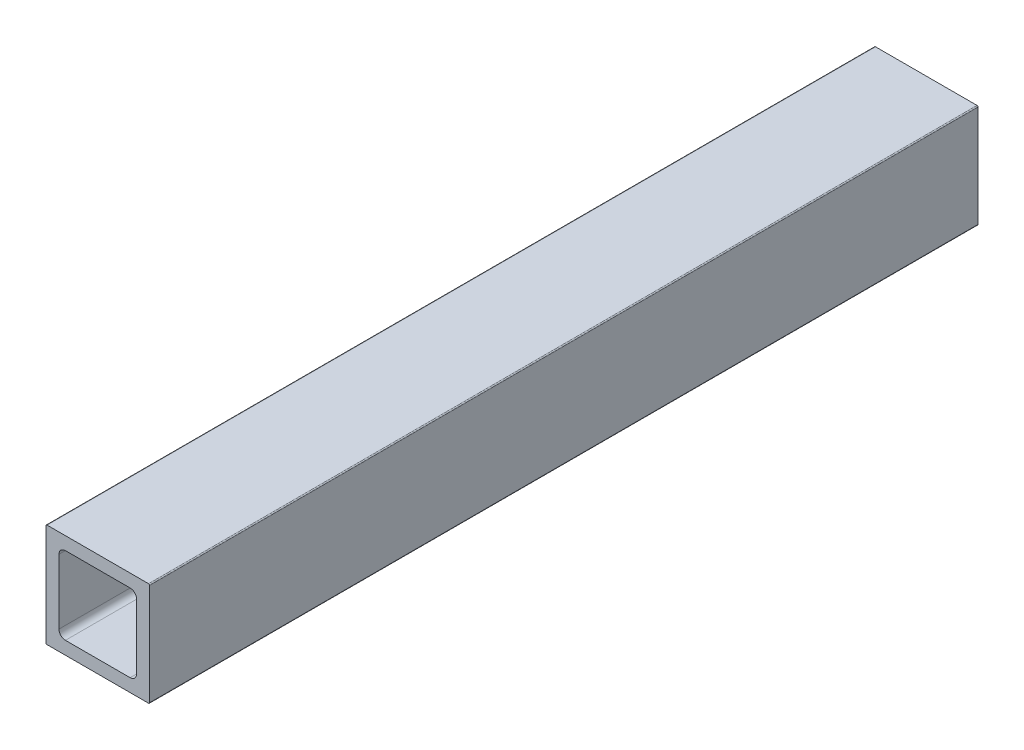
ISO-10303-21;
HEADER;
FILE_DESCRIPTION(('STEP AP214'),'2;1');
FILE_NAME('part.step','',(''),(''),'','','');
FILE_SCHEMA(('AUTOMOTIVE_DESIGN { 1 0 10303 214 1 1 1 1 }'));
ENDSEC;
DATA;
#1=APPLICATION_CONTEXT('core data for automotive mechanical design processes');
#2=APPLICATION_PROTOCOL_DEFINITION('international standard','automotive_design',2000,#1);
#3=PRODUCT_CONTEXT('',#1,'mechanical');
#4=PRODUCT('Part','Part','',(#3));
#5=PRODUCT_RELATED_PRODUCT_CATEGORY('part','',(#4));
#6=PRODUCT_DEFINITION_FORMATION('','',#4);
#7=PRODUCT_DEFINITION_CONTEXT('part definition',#1,'design');
#8=PRODUCT_DEFINITION('design','',#6,#7);
#9=PRODUCT_DEFINITION_SHAPE('','',#8);
#10=(LENGTH_UNIT() NAMED_UNIT(*) SI_UNIT(.MILLI.,.METRE.));
#11=(NAMED_UNIT(*) PLANE_ANGLE_UNIT() SI_UNIT($,.RADIAN.));
#12=(NAMED_UNIT(*) SI_UNIT($,.STERADIAN.) SOLID_ANGLE_UNIT());
#13=UNCERTAINTY_MEASURE_WITH_UNIT(LENGTH_MEASURE(1.E-05),#10,'distance_accuracy_value','');
#14=(GEOMETRIC_REPRESENTATION_CONTEXT(3) GLOBAL_UNCERTAINTY_ASSIGNED_CONTEXT((#13)) GLOBAL_UNIT_ASSIGNED_CONTEXT((#10,
#11,#12)) REPRESENTATION_CONTEXT('',''));
#15=CARTESIAN_POINT('',(0.,0.,0.));
#16=DIRECTION('',(0.,0.,1.));
#17=DIRECTION('',(1.,0.,0.));
#18=AXIS2_PLACEMENT_3D('',#15,#16,#17);
#19=CARTESIAN_POINT('',(3.175,4.7625,1828.8));
#20=DIRECTION('',(1.,0.,0.));
#21=DIRECTION('',(0.,1.,0.));
#22=AXIS2_PLACEMENT_3D('',#19,#20,#21);
#23=PLANE('',#22);
#24=DIRECTION('',(0.,-1.,0.));
#25=VECTOR('',#24,1.);
#26=CARTESIAN_POINT('',(3.175,4.7625,1625.6));
#27=LINE('',#26,#25);
#28=CARTESIAN_POINT('',(3.175,20.6375,1625.6));
#29=VERTEX_POINT('',#28);
#30=CARTESIAN_POINT('',(3.175,4.7625,1625.6));
#31=VERTEX_POINT('',#30);
#32=EDGE_CURVE('E58',#29,#31,#27,.T.);
#33=ORIENTED_EDGE('',*,*,#32,.F.);
#34=DIRECTION('',(0.,0.,-1.));
#35=VECTOR('',#34,1.);
#36=CARTESIAN_POINT('',(3.175,20.6375,1828.8));
#37=LINE('',#36,#35);
#38=CARTESIAN_POINT('',(3.175,20.6375,1828.8));
#39=VERTEX_POINT('',#38);
#40=EDGE_CURVE('E51',#39,#29,#37,.T.);
#41=ORIENTED_EDGE('',*,*,#40,.F.);
#42=DIRECTION('',(0.,-1.,0.));
#43=VECTOR('',#42,1.);
#44=CARTESIAN_POINT('',(3.175,4.7625,1828.8));
#45=LINE('',#44,#43);
#46=CARTESIAN_POINT('',(3.175,4.7625,1828.8));
#47=VERTEX_POINT('',#46);
#48=EDGE_CURVE('E217',#39,#47,#45,.T.);
#49=ORIENTED_EDGE('',*,*,#48,.T.);
#50=DIRECTION('',(0.,0.,-1.));
#51=VECTOR('',#50,1.);
#52=CARTESIAN_POINT('',(3.175,4.7625,1828.8));
#53=LINE('',#52,#51);
#54=EDGE_CURVE('E323',#47,#31,#53,.T.);
#55=ORIENTED_EDGE('',*,*,#54,.T.);
#56=EDGE_LOOP('',(#33,#41,#49,#55));
#57=FACE_BOUND('',#56,.T.);
#58=ADVANCED_FACE('F43',(#57),#23,.T.);
#59=CARTESIAN_POINT('',(4.7625,20.6375,1828.8));
#60=DIRECTION('',(0.,0.,-1.));
#61=DIRECTION('',(-1.,0.,0.));
#62=AXIS2_PLACEMENT_3D('',#59,#60,#61);
#63=CYLINDRICAL_SURFACE('',#62,1.5875);
#64=ORIENTED_EDGE('',*,*,#40,.T.);
#65=CARTESIAN_POINT('',(4.7625,20.6375,1625.6));
#66=DIRECTION('',(0.,0.,1.));
#67=DIRECTION('',(1.,0.,0.));
#68=AXIS2_PLACEMENT_3D('',#65,#66,#67);
#69=CIRCLE('',#68,1.5875);
#70=CARTESIAN_POINT('',(4.7625,22.225,1625.6));
#71=VERTEX_POINT('',#70);
#72=EDGE_CURVE('E302',#29,#71,#69,.F.);
#73=ORIENTED_EDGE('',*,*,#72,.T.);
#74=DIRECTION('',(0.,0.,-1.));
#75=VECTOR('',#74,1.);
#76=CARTESIAN_POINT('',(4.7625,22.225,1828.8));
#77=LINE('',#76,#75);
#78=CARTESIAN_POINT('',(4.7625,22.225,1828.8));
#79=VERTEX_POINT('',#78);
#80=EDGE_CURVE('E290',#79,#71,#77,.T.);
#81=ORIENTED_EDGE('',*,*,#80,.F.);
#82=CARTESIAN_POINT('',(4.7625,20.6375,1828.8));
#83=DIRECTION('',(0.,0.,1.));
#84=DIRECTION('',(-1.,0.,0.));
#85=AXIS2_PLACEMENT_3D('',#82,#83,#84);
#86=CIRCLE('',#85,1.5875);
#87=EDGE_CURVE('E222',#79,#39,#86,.T.);
#88=ORIENTED_EDGE('',*,*,#87,.T.);
#89=EDGE_LOOP('',(#64,#73,#81,#88));
#90=FACE_BOUND('',#89,.T.);
#91=ADVANCED_FACE('F300',(#90),#63,.F.);
#92=CARTESIAN_POINT('',(4.7625,22.225,1828.8));
#93=DIRECTION('',(0.,-1.,0.));
#94=DIRECTION('',(0.,0.,-1.));
#95=AXIS2_PLACEMENT_3D('',#92,#93,#94);
#96=PLANE('',#95);
#97=DIRECTION('',(-1.,0.,0.));
#98=VECTOR('',#97,1.);
#99=CARTESIAN_POINT('',(4.7625,22.225,1625.6));
#100=LINE('',#99,#98);
#101=CARTESIAN_POINT('',(20.6375,22.225,1625.6));
#102=VERTEX_POINT('',#101);
#103=EDGE_CURVE('E338',#102,#71,#100,.T.);
#104=ORIENTED_EDGE('',*,*,#103,.F.);
#105=DIRECTION('',(0.,0.,-1.));
#106=VECTOR('',#105,1.);
#107=CARTESIAN_POINT('',(20.6375,22.225,1828.8));
#108=LINE('',#107,#106);
#109=CARTESIAN_POINT('',(20.6375,22.225,1828.8));
#110=VERTEX_POINT('',#109);
#111=EDGE_CURVE('E237',#110,#102,#108,.T.);
#112=ORIENTED_EDGE('',*,*,#111,.F.);
#113=DIRECTION('',(-1.,0.,0.));
#114=VECTOR('',#113,1.);
#115=CARTESIAN_POINT('',(4.7625,22.225,1828.8));
#116=LINE('',#115,#114);
#117=EDGE_CURVE('E226',#110,#79,#116,.T.);
#118=ORIENTED_EDGE('',*,*,#117,.T.);
#119=ORIENTED_EDGE('',*,*,#80,.T.);
#120=EDGE_LOOP('',(#104,#112,#118,#119));
#121=FACE_BOUND('',#120,.T.);
#122=ADVANCED_FACE('F289',(#121),#96,.T.);
#123=CARTESIAN_POINT('',(20.6375,20.6375,1828.8));
#124=DIRECTION('',(0.,0.,-1.));
#125=DIRECTION('',(-1.,0.,0.));
#126=AXIS2_PLACEMENT_3D('',#123,#124,#125);
#127=CYLINDRICAL_SURFACE('',#126,1.5875);
#128=ORIENTED_EDGE('',*,*,#111,.T.);
#129=CARTESIAN_POINT('',(20.6375,20.6375,1625.6));
#130=DIRECTION('',(0.,0.,1.));
#131=DIRECTION('',(1.,0.,0.));
#132=AXIS2_PLACEMENT_3D('',#129,#130,#131);
#133=CIRCLE('',#132,1.5875);
#134=CARTESIAN_POINT('',(22.225,20.6375,1625.6));
#135=VERTEX_POINT('',#134);
#136=EDGE_CURVE('E340',#102,#135,#133,.F.);
#137=ORIENTED_EDGE('',*,*,#136,.T.);
#138=DIRECTION('',(0.,0.,-1.));
#139=VECTOR('',#138,1.);
#140=CARTESIAN_POINT('',(22.225,20.6375,1828.8));
#141=LINE('',#140,#139);
#142=CARTESIAN_POINT('',(22.225,20.6375,1828.8));
#143=VERTEX_POINT('',#142);
#144=EDGE_CURVE('E233',#143,#135,#141,.T.);
#145=ORIENTED_EDGE('',*,*,#144,.F.);
#146=CARTESIAN_POINT('',(20.6375,20.6375,1828.8));
#147=DIRECTION('',(0.,0.,1.));
#148=DIRECTION('',(-1.,0.,0.));
#149=AXIS2_PLACEMENT_3D('',#146,#147,#148);
#150=CIRCLE('',#149,1.5875);
#151=EDGE_CURVE('E212',#143,#110,#150,.T.);
#152=ORIENTED_EDGE('',*,*,#151,.T.);
#153=EDGE_LOOP('',(#128,#137,#145,#152));
#154=FACE_BOUND('',#153,.T.);
#155=ADVANCED_FACE('F525',(#154),#127,.F.);
#156=CARTESIAN_POINT('',(22.225,4.7625,1828.8));
#157=DIRECTION('',(-1.,0.,0.));
#158=DIRECTION('',(0.,0.,1.));
#159=AXIS2_PLACEMENT_3D('',#156,#157,#158);
#160=PLANE('',#159);
#161=DIRECTION('',(0.,1.,0.));
#162=VECTOR('',#161,1.);
#163=CARTESIAN_POINT('',(22.225,4.7625,1625.6));
#164=LINE('',#163,#162);
#165=CARTESIAN_POINT('',(22.225,4.7625,1625.6));
#166=VERTEX_POINT('',#165);
#167=EDGE_CURVE('E343',#166,#135,#164,.T.);
#168=ORIENTED_EDGE('',*,*,#167,.F.);
#169=DIRECTION('',(0.,0.,-1.));
#170=VECTOR('',#169,1.);
#171=CARTESIAN_POINT('',(22.225,4.7625,1828.8));
#172=LINE('',#171,#170);
#173=CARTESIAN_POINT('',(22.225,4.7625,1828.8));
#174=VERTEX_POINT('',#173);
#175=EDGE_CURVE('E238',#174,#166,#172,.T.);
#176=ORIENTED_EDGE('',*,*,#175,.F.);
#177=DIRECTION('',(0.,1.,0.));
#178=VECTOR('',#177,1.);
#179=CARTESIAN_POINT('',(22.225,4.7625,1828.8));
#180=LINE('',#179,#178);
#181=EDGE_CURVE('E207',#174,#143,#180,.T.);
#182=ORIENTED_EDGE('',*,*,#181,.T.);
#183=ORIENTED_EDGE('',*,*,#144,.T.);
#184=EDGE_LOOP('',(#168,#176,#182,#183));
#185=FACE_BOUND('',#184,.T.);
#186=ADVANCED_FACE('F395',(#185),#160,.T.);
#187=CARTESIAN_POINT('',(20.6375,4.7625,1828.8));
#188=DIRECTION('',(0.,0.,-1.));
#189=DIRECTION('',(-1.,0.,0.));
#190=AXIS2_PLACEMENT_3D('',#187,#188,#189);
#191=CYLINDRICAL_SURFACE('',#190,1.5875);
#192=ORIENTED_EDGE('',*,*,#175,.T.);
#193=CARTESIAN_POINT('',(20.6375,4.7625,1625.6));
#194=DIRECTION('',(0.,0.,1.));
#195=DIRECTION('',(1.,0.,0.));
#196=AXIS2_PLACEMENT_3D('',#193,#194,#195);
#197=CIRCLE('',#196,1.5875);
#198=CARTESIAN_POINT('',(20.6375,3.175,1625.6));
#199=VERTEX_POINT('',#198);
#200=EDGE_CURVE('E345',#166,#199,#197,.F.);
#201=ORIENTED_EDGE('',*,*,#200,.T.);
#202=DIRECTION('',(0.,0.,-1.));
#203=VECTOR('',#202,1.);
#204=CARTESIAN_POINT('',(20.6375,3.175,1828.8));
#205=LINE('',#204,#203);
#206=CARTESIAN_POINT('',(20.6375,3.175,1828.8));
#207=VERTEX_POINT('',#206);
#208=EDGE_CURVE('E264',#207,#199,#205,.T.);
#209=ORIENTED_EDGE('',*,*,#208,.F.);
#210=CARTESIAN_POINT('',(20.6375,4.7625,1828.8));
#211=DIRECTION('',(0.,0.,1.));
#212=DIRECTION('',(-1.,0.,0.));
#213=AXIS2_PLACEMENT_3D('',#210,#211,#212);
#214=CIRCLE('',#213,1.5875);
#215=EDGE_CURVE('E211',#207,#174,#214,.T.);
#216=ORIENTED_EDGE('',*,*,#215,.T.);
#217=EDGE_LOOP('',(#192,#201,#209,#216));
#218=FACE_BOUND('',#217,.T.);
#219=ADVANCED_FACE('F392',(#218),#191,.F.);
#220=CARTESIAN_POINT('',(4.7625,3.175,1828.8));
#221=DIRECTION('',(0.,1.,0.));
#222=DIRECTION('',(1.,0.,0.));
#223=AXIS2_PLACEMENT_3D('',#220,#221,#222);
#224=PLANE('',#223);
#225=DIRECTION('',(1.,0.,0.));
#226=VECTOR('',#225,1.);
#227=CARTESIAN_POINT('',(4.7625,3.175,1625.6));
#228=LINE('',#227,#226);
#229=CARTESIAN_POINT('',(4.7625,3.175,1625.6));
#230=VERTEX_POINT('',#229);
#231=EDGE_CURVE('E348',#230,#199,#228,.T.);
#232=ORIENTED_EDGE('',*,*,#231,.F.);
#233=DIRECTION('',(0.,0.,-1.));
#234=VECTOR('',#233,1.);
#235=CARTESIAN_POINT('',(4.7625,3.175,1828.8));
#236=LINE('',#235,#234);
#237=CARTESIAN_POINT('',(4.7625,3.175,1828.8));
#238=VERTEX_POINT('',#237);
#239=EDGE_CURVE('E268',#238,#230,#236,.T.);
#240=ORIENTED_EDGE('',*,*,#239,.F.);
#241=DIRECTION('',(1.,0.,0.));
#242=VECTOR('',#241,1.);
#243=CARTESIAN_POINT('',(4.7625,3.175,1828.8));
#244=LINE('',#243,#242);
#245=EDGE_CURVE('E254',#238,#207,#244,.T.);
#246=ORIENTED_EDGE('',*,*,#245,.T.);
#247=ORIENTED_EDGE('',*,*,#208,.T.);
#248=EDGE_LOOP('',(#232,#240,#246,#247));
#249=FACE_BOUND('',#248,.T.);
#250=ADVANCED_FACE('F394',(#249),#224,.T.);
#251=CARTESIAN_POINT('',(4.7625,4.7625,1828.8));
#252=DIRECTION('',(0.,0.,-1.));
#253=DIRECTION('',(-1.,0.,0.));
#254=AXIS2_PLACEMENT_3D('',#251,#252,#253);
#255=CYLINDRICAL_SURFACE('',#254,1.5875);
#256=ORIENTED_EDGE('',*,*,#239,.T.);
#257=CARTESIAN_POINT('',(4.7625,4.7625,1625.6));
#258=DIRECTION('',(0.,0.,1.));
#259=DIRECTION('',(1.,0.,0.));
#260=AXIS2_PLACEMENT_3D('',#257,#258,#259);
#261=CIRCLE('',#260,1.5875);
#262=EDGE_CURVE('E350',#230,#31,#261,.F.);
#263=ORIENTED_EDGE('',*,*,#262,.T.);
#264=ORIENTED_EDGE('',*,*,#54,.F.);
#265=CARTESIAN_POINT('',(4.7625,4.7625,1828.8));
#266=DIRECTION('',(0.,0.,1.));
#267=DIRECTION('',(1.,0.,0.));
#268=AXIS2_PLACEMENT_3D('',#265,#266,#267);
#269=CIRCLE('',#268,1.5875);
#270=EDGE_CURVE('E213',#47,#238,#269,.T.);
#271=ORIENTED_EDGE('',*,*,#270,.T.);
#272=EDGE_LOOP('',(#256,#263,#264,#271));
#273=FACE_BOUND('',#272,.T.);
#274=ADVANCED_FACE('F508',(#273),#255,.F.);
#275=CARTESIAN_POINT('',(0.,0.254,1828.8));
#276=DIRECTION('',(1.,0.,0.));
#277=DIRECTION('',(0.,1.,0.));
#278=AXIS2_PLACEMENT_3D('',#275,#276,#277);
#279=PLANE('',#278);
#280=DIRECTION('',(0.,0.,-1.));
#281=VECTOR('',#280,1.);
#282=CARTESIAN_POINT('',(0.,25.146,1828.8));
#283=LINE('',#282,#281);
#284=CARTESIAN_POINT('',(0.,25.146,1828.8));
#285=VERTEX_POINT('',#284);
#286=CARTESIAN_POINT('',(0.,25.146,1625.6));
#287=VERTEX_POINT('',#286);
#288=EDGE_CURVE('E263',#285,#287,#283,.T.);
#289=ORIENTED_EDGE('',*,*,#288,.T.);
#290=DIRECTION('',(0.,-1.,0.));
#291=VECTOR('',#290,1.);
#292=CARTESIAN_POINT('',(0.,0.254,1625.6));
#293=LINE('',#292,#291);
#294=CARTESIAN_POINT('',(0.,0.254,1625.6));
#295=VERTEX_POINT('',#294);
#296=EDGE_CURVE('E185',#287,#295,#293,.T.);
#297=ORIENTED_EDGE('',*,*,#296,.T.);
#298=DIRECTION('',(0.,0.,-1.));
#299=VECTOR('',#298,1.);
#300=CARTESIAN_POINT('',(0.,0.254,1828.8));
#301=LINE('',#300,#299);
#302=CARTESIAN_POINT('',(0.,0.254,1828.8));
#303=VERTEX_POINT('',#302);
#304=EDGE_CURVE('E194',#303,#295,#301,.T.);
#305=ORIENTED_EDGE('',*,*,#304,.F.);
#306=DIRECTION('',(0.,-1.,0.));
#307=VECTOR('',#306,1.);
#308=CARTESIAN_POINT('',(0.,0.254,1828.8));
#309=LINE('',#308,#307);
#310=EDGE_CURVE('E218',#285,#303,#309,.T.);
#311=ORIENTED_EDGE('',*,*,#310,.F.);
#312=EDGE_LOOP('',(#289,#297,#305,#311));
#313=FACE_BOUND('',#312,.T.);
#314=ADVANCED_FACE('F502',(#313),#279,.F.);
#315=CARTESIAN_POINT('',(0.254,25.146,1828.8));
#316=DIRECTION('',(0.,0.,-1.));
#317=DIRECTION('',(-1.,0.,0.));
#318=AXIS2_PLACEMENT_3D('',#315,#316,#317);
#319=CYLINDRICAL_SURFACE('',#318,0.254);
#320=CARTESIAN_POINT('',(0.254,25.146,1625.6));
#321=DIRECTION('',(0.,0.,1.));
#322=DIRECTION('',(1.,0.,0.));
#323=AXIS2_PLACEMENT_3D('',#320,#321,#322);
#324=CIRCLE('',#323,0.254);
#325=CARTESIAN_POINT('',(0.254000000000004,25.4,1625.6));
#326=VERTEX_POINT('',#325);
#327=EDGE_CURVE('E176',#287,#326,#324,.F.);
#328=ORIENTED_EDGE('',*,*,#327,.F.);
#329=ORIENTED_EDGE('',*,*,#288,.F.);
#330=CARTESIAN_POINT('',(0.254,25.146,1828.8));
#331=DIRECTION('',(0.,0.,1.));
#332=DIRECTION('',(-1.,0.,0.));
#333=AXIS2_PLACEMENT_3D('',#330,#331,#332);
#334=CIRCLE('',#333,0.254);
#335=CARTESIAN_POINT('',(0.254,25.4,1828.8));
#336=VERTEX_POINT('',#335);
#337=EDGE_CURVE('E239',#336,#285,#334,.T.);
#338=ORIENTED_EDGE('',*,*,#337,.F.);
#339=DIRECTION('',(0.,0.,-1.));
#340=VECTOR('',#339,1.);
#341=CARTESIAN_POINT('',(0.254,25.4,1828.8));
#342=LINE('',#341,#340);
#343=EDGE_CURVE('E259',#336,#326,#342,.T.);
#344=ORIENTED_EDGE('',*,*,#343,.T.);
#345=EDGE_LOOP('',(#328,#329,#338,#344));
#346=FACE_BOUND('',#345,.T.);
#347=ADVANCED_FACE('F507',(#346),#319,.T.);
#348=CARTESIAN_POINT('',(0.254,25.4,1828.8));
#349=DIRECTION('',(0.,-1.,0.));
#350=DIRECTION('',(0.,0.,-1.));
#351=AXIS2_PLACEMENT_3D('',#348,#349,#350);
#352=PLANE('',#351);
#353=DIRECTION('',(0.,0.,-1.));
#354=VECTOR('',#353,1.);
#355=CARTESIAN_POINT('',(25.146,25.4,1828.8));
#356=LINE('',#355,#354);
#357=CARTESIAN_POINT('',(25.146,25.4,1828.8));
#358=VERTEX_POINT('',#357);
#359=CARTESIAN_POINT('',(25.146,25.4,1625.6));
#360=VERTEX_POINT('',#359);
#361=EDGE_CURVE('E255',#358,#360,#356,.T.);
#362=ORIENTED_EDGE('',*,*,#361,.T.);
#363=DIRECTION('',(1.,0.,0.));
#364=VECTOR('',#363,1.);
#365=CARTESIAN_POINT('',(-135.222379220066,25.4,1625.6));
#366=LINE('',#365,#364);
#367=EDGE_CURVE('E186',#326,#360,#366,.T.);
#368=ORIENTED_EDGE('',*,*,#367,.F.);
#369=ORIENTED_EDGE('',*,*,#343,.F.);
#370=DIRECTION('',(-1.,0.,0.));
#371=VECTOR('',#370,1.);
#372=CARTESIAN_POINT('',(0.254,25.4,1828.8));
#373=LINE('',#372,#371);
#374=EDGE_CURVE('E231',#358,#336,#373,.T.);
#375=ORIENTED_EDGE('',*,*,#374,.F.);
#376=EDGE_LOOP('',(#362,#368,#369,#375));
#377=FACE_BOUND('',#376,.T.);
#378=ADVANCED_FACE('F365',(#377),#352,.F.);
#379=CARTESIAN_POINT('',(25.146,25.146,1828.8));
#380=DIRECTION('',(0.,0.,-1.));
#381=DIRECTION('',(-1.,0.,0.));
#382=AXIS2_PLACEMENT_3D('',#379,#380,#381);
#383=CYLINDRICAL_SURFACE('',#382,0.254);
#384=CARTESIAN_POINT('',(25.146,25.146,1625.6));
#385=DIRECTION('',(0.,0.,1.));
#386=DIRECTION('',(1.,0.,0.));
#387=AXIS2_PLACEMENT_3D('',#384,#385,#386);
#388=CIRCLE('',#387,0.254);
#389=CARTESIAN_POINT('',(25.4,25.146,1625.6));
#390=VERTEX_POINT('',#389);
#391=EDGE_CURVE('E352',#360,#390,#388,.F.);
#392=ORIENTED_EDGE('',*,*,#391,.F.);
#393=ORIENTED_EDGE('',*,*,#361,.F.);
#394=CARTESIAN_POINT('',(25.146,25.146,1828.8));
#395=DIRECTION('',(0.,0.,1.));
#396=DIRECTION('',(-1.,0.,0.));
#397=AXIS2_PLACEMENT_3D('',#394,#395,#396);
#398=CIRCLE('',#397,0.254);
#399=CARTESIAN_POINT('',(25.4,25.146,1828.8));
#400=VERTEX_POINT('',#399);
#401=EDGE_CURVE('E227',#400,#358,#398,.T.);
#402=ORIENTED_EDGE('',*,*,#401,.F.);
#403=DIRECTION('',(0.,0.,-1.));
#404=VECTOR('',#403,1.);
#405=CARTESIAN_POINT('',(25.4,25.146,1828.8));
#406=LINE('',#405,#404);
#407=EDGE_CURVE('E200',#400,#390,#406,.T.);
#408=ORIENTED_EDGE('',*,*,#407,.T.);
#409=EDGE_LOOP('',(#392,#393,#402,#408));
#410=FACE_BOUND('',#409,.T.);
#411=ADVANCED_FACE('F45',(#410),#383,.T.);
#412=CARTESIAN_POINT('',(25.4,0.254,1828.8));
#413=DIRECTION('',(-1.,0.,0.));
#414=DIRECTION('',(0.,0.,1.));
#415=AXIS2_PLACEMENT_3D('',#412,#413,#414);
#416=PLANE('',#415);
#417=DIRECTION('',(0.,0.,-1.));
#418=VECTOR('',#417,1.);
#419=CARTESIAN_POINT('',(25.4,0.254,1828.8));
#420=LINE('',#419,#418);
#421=CARTESIAN_POINT('',(25.4,0.254,1828.8));
#422=VERTEX_POINT('',#421);
#423=CARTESIAN_POINT('',(25.4,0.254,1625.6));
#424=VERTEX_POINT('',#423);
#425=EDGE_CURVE('E193',#422,#424,#420,.T.);
#426=ORIENTED_EDGE('',*,*,#425,.T.);
#427=DIRECTION('',(0.,1.,0.));
#428=VECTOR('',#427,1.);
#429=CARTESIAN_POINT('',(25.4,0.254,1625.6));
#430=LINE('',#429,#428);
#431=EDGE_CURVE('E172',#424,#390,#430,.T.);
#432=ORIENTED_EDGE('',*,*,#431,.T.);
#433=ORIENTED_EDGE('',*,*,#407,.F.);
#434=DIRECTION('',(0.,1.,0.));
#435=VECTOR('',#434,1.);
#436=CARTESIAN_POINT('',(25.4,0.254,1828.8));
#437=LINE('',#436,#435);
#438=EDGE_CURVE('E232',#422,#400,#437,.T.);
#439=ORIENTED_EDGE('',*,*,#438,.F.);
#440=EDGE_LOOP('',(#426,#432,#433,#439));
#441=FACE_BOUND('',#440,.T.);
#442=ADVANCED_FACE('F369',(#441),#416,.F.);
#443=CARTESIAN_POINT('',(25.146,0.254,1828.8));
#444=DIRECTION('',(0.,0.,-1.));
#445=DIRECTION('',(-1.,0.,0.));
#446=AXIS2_PLACEMENT_3D('',#443,#444,#445);
#447=CYLINDRICAL_SURFACE('',#446,0.254);
#448=CARTESIAN_POINT('',(25.146,0.254,1625.6));
#449=DIRECTION('',(0.,0.,1.));
#450=DIRECTION('',(1.,0.,0.));
#451=AXIS2_PLACEMENT_3D('',#448,#449,#450);
#452=CIRCLE('',#451,0.254);
#453=CARTESIAN_POINT('',(25.146,0.,1625.6));
#454=VERTEX_POINT('',#453);
#455=EDGE_CURVE('E169',#424,#454,#452,.F.);
#456=ORIENTED_EDGE('',*,*,#455,.F.);
#457=ORIENTED_EDGE('',*,*,#425,.F.);
#458=CARTESIAN_POINT('',(25.146,0.254,1828.8));
#459=DIRECTION('',(0.,0.,1.));
#460=DIRECTION('',(1.,0.,0.));
#461=AXIS2_PLACEMENT_3D('',#458,#459,#460);
#462=CIRCLE('',#461,0.254);
#463=CARTESIAN_POINT('',(25.146,0.,1828.8));
#464=VERTEX_POINT('',#463);
#465=EDGE_CURVE('E190',#464,#422,#462,.T.);
#466=ORIENTED_EDGE('',*,*,#465,.F.);
#467=DIRECTION('',(0.,0.,-1.));
#468=VECTOR('',#467,1.);
#469=CARTESIAN_POINT('',(25.146,0.,1828.8));
#470=LINE('',#469,#468);
#471=EDGE_CURVE('E182',#464,#454,#470,.T.);
#472=ORIENTED_EDGE('',*,*,#471,.T.);
#473=EDGE_LOOP('',(#456,#457,#466,#472));
#474=FACE_BOUND('',#473,.T.);
#475=ADVANCED_FACE('F188',(#474),#447,.T.);
#476=CARTESIAN_POINT('',(0.254,0.,1828.8));
#477=DIRECTION('',(0.,1.,0.));
#478=DIRECTION('',(1.,0.,0.));
#479=AXIS2_PLACEMENT_3D('',#476,#477,#478);
#480=PLANE('',#479);
#481=DIRECTION('',(0.,0.,-1.));
#482=VECTOR('',#481,1.);
#483=CARTESIAN_POINT('',(0.254,0.,1828.8));
#484=LINE('',#483,#482);
#485=CARTESIAN_POINT('',(0.254,0.,1828.8));
#486=VERTEX_POINT('',#485);
#487=CARTESIAN_POINT('',(0.254,0.,1625.6));
#488=VERTEX_POINT('',#487);
#489=EDGE_CURVE('E184',#486,#488,#484,.T.);
#490=ORIENTED_EDGE('',*,*,#489,.T.);
#491=DIRECTION('',(-1.,0.,0.));
#492=VECTOR('',#491,1.);
#493=CARTESIAN_POINT('',(-135.222379220066,0.,1625.6));
#494=LINE('',#493,#492);
#495=EDGE_CURVE('E65',#454,#488,#494,.T.);
#496=ORIENTED_EDGE('',*,*,#495,.F.);
#497=ORIENTED_EDGE('',*,*,#471,.F.);
#498=DIRECTION('',(1.,0.,0.));
#499=VECTOR('',#498,1.);
#500=CARTESIAN_POINT('',(0.254,0.,1828.8));
#501=LINE('',#500,#499);
#502=EDGE_CURVE('E248',#486,#464,#501,.T.);
#503=ORIENTED_EDGE('',*,*,#502,.F.);
#504=EDGE_LOOP('',(#490,#496,#497,#503));
#505=FACE_BOUND('',#504,.T.);
#506=ADVANCED_FACE('F180',(#505),#480,.F.);
#507=CARTESIAN_POINT('',(0.254,0.254,1828.8));
#508=DIRECTION('',(0.,0.,-1.));
#509=DIRECTION('',(-1.,0.,0.));
#510=AXIS2_PLACEMENT_3D('',#507,#508,#509);
#511=CYLINDRICAL_SURFACE('',#510,0.254);
#512=CARTESIAN_POINT('',(0.254,0.254,1625.6));
#513=DIRECTION('',(0.,0.,1.));
#514=DIRECTION('',(1.,0.,0.));
#515=AXIS2_PLACEMENT_3D('',#512,#513,#514);
#516=CIRCLE('',#515,0.254);
#517=EDGE_CURVE('E11',#488,#295,#516,.F.);
#518=ORIENTED_EDGE('',*,*,#517,.F.);
#519=ORIENTED_EDGE('',*,*,#489,.F.);
#520=CARTESIAN_POINT('',(0.254,0.254,1828.8));
#521=DIRECTION('',(0.,0.,1.));
#522=DIRECTION('',(-1.,0.,0.));
#523=AXIS2_PLACEMENT_3D('',#520,#521,#522);
#524=CIRCLE('',#523,0.254);
#525=EDGE_CURVE('E251',#303,#486,#524,.T.);
#526=ORIENTED_EDGE('',*,*,#525,.F.);
#527=ORIENTED_EDGE('',*,*,#304,.T.);
#528=EDGE_LOOP('',(#518,#519,#526,#527));
#529=FACE_BOUND('',#528,.T.);
#530=ADVANCED_FACE('F388',(#529),#511,.T.);
#531=CARTESIAN_POINT('',(0.254,0.254,1828.8));
#532=DIRECTION('',(0.,0.,-1.));
#533=DIRECTION('',(0.,-1.,0.));
#534=AXIS2_PLACEMENT_3D('',#531,#532,#533);
#535=PLANE('',#534);
#536=ORIENTED_EDGE('',*,*,#270,.F.);
#537=ORIENTED_EDGE('',*,*,#48,.F.);
#538=ORIENTED_EDGE('',*,*,#87,.F.);
#539=ORIENTED_EDGE('',*,*,#117,.F.);
#540=ORIENTED_EDGE('',*,*,#151,.F.);
#541=ORIENTED_EDGE('',*,*,#181,.F.);
#542=ORIENTED_EDGE('',*,*,#215,.F.);
#543=ORIENTED_EDGE('',*,*,#245,.F.);
#544=EDGE_LOOP('',(#536,#537,#538,#539,#540,#541,#542,#543));
#545=FACE_BOUND('',#544,.T.);
#546=ORIENTED_EDGE('',*,*,#525,.T.);
#547=ORIENTED_EDGE('',*,*,#502,.T.);
#548=ORIENTED_EDGE('',*,*,#465,.T.);
#549=ORIENTED_EDGE('',*,*,#438,.T.);
#550=ORIENTED_EDGE('',*,*,#401,.T.);
#551=ORIENTED_EDGE('',*,*,#374,.T.);
#552=ORIENTED_EDGE('',*,*,#337,.T.);
#553=ORIENTED_EDGE('',*,*,#310,.T.);
#554=EDGE_LOOP('',(#546,#547,#548,#549,#550,#551,#552,#553));
#555=FACE_BOUND('',#554,.T.);
#556=ADVANCED_FACE('F296',(#545,#555),#535,.F.);
#557=CARTESIAN_POINT('',(-135.222379220066,-1647.92583637368,1625.6));
#558=DIRECTION('',(0.,0.,1.));
#559=DIRECTION('',(1.,0.,0.));
#560=AXIS2_PLACEMENT_3D('',#557,#558,#559);
#561=PLANE('',#560);
#562=ORIENTED_EDGE('',*,*,#32,.T.);
#563=ORIENTED_EDGE('',*,*,#262,.F.);
#564=ORIENTED_EDGE('',*,*,#231,.T.);
#565=ORIENTED_EDGE('',*,*,#200,.F.);
#566=ORIENTED_EDGE('',*,*,#167,.T.);
#567=ORIENTED_EDGE('',*,*,#136,.F.);
#568=ORIENTED_EDGE('',*,*,#103,.T.);
#569=ORIENTED_EDGE('',*,*,#72,.F.);
#570=EDGE_LOOP('',(#562,#563,#564,#565,#566,#567,#568,#569));
#571=FACE_BOUND('',#570,.T.);
#572=ORIENTED_EDGE('',*,*,#391,.T.);
#573=ORIENTED_EDGE('',*,*,#431,.F.);
#574=ORIENTED_EDGE('',*,*,#455,.T.);
#575=ORIENTED_EDGE('',*,*,#495,.T.);
#576=ORIENTED_EDGE('',*,*,#517,.T.);
#577=ORIENTED_EDGE('',*,*,#296,.F.);
#578=ORIENTED_EDGE('',*,*,#327,.T.);
#579=ORIENTED_EDGE('',*,*,#367,.T.);
#580=EDGE_LOOP('',(#572,#573,#574,#575,#576,#577,#578,#579));
#581=FACE_BOUND('',#580,.T.);
#582=ADVANCED_FACE('F170',(#571,#581),#561,.F.);
#583=CLOSED_SHELL('',(#58,#91,#122,#155,#186,#219,#250,#274,#314,#347,#378,#411,#442,#475,#506,
#530,#556,#582));
#584=MANIFOLD_SOLID_BREP('B2',#583);
#585=ADVANCED_BREP_SHAPE_REPRESENTATION('',(#18,#584),#14);
#586=SHAPE_DEFINITION_REPRESENTATION(#9,#585);
ENDSEC;
END-ISO-10303-21;
